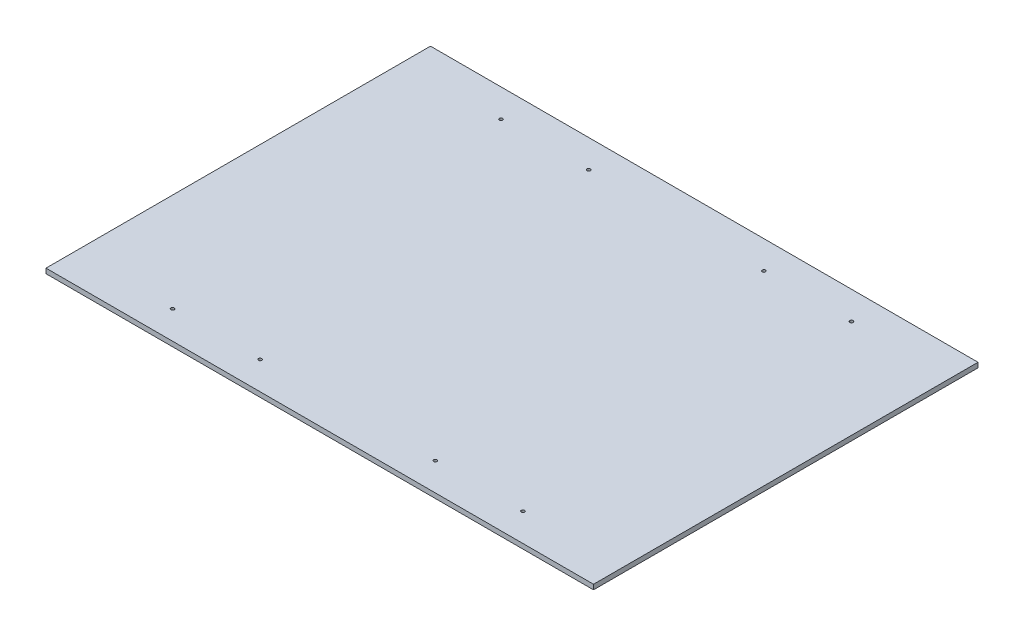
ISO-10303-21;
HEADER;
FILE_DESCRIPTION(('STEP AP214'),'2;1');
FILE_NAME('part.step','',(''),(''),'','','');
FILE_SCHEMA(('AUTOMOTIVE_DESIGN { 1 0 10303 214 1 1 1 1 }'));
ENDSEC;
DATA;
#1=APPLICATION_CONTEXT('core data for automotive mechanical design processes');
#2=APPLICATION_PROTOCOL_DEFINITION('international standard','automotive_design',2000,#1);
#3=PRODUCT_CONTEXT('',#1,'mechanical');
#4=PRODUCT('Part','Part','',(#3));
#5=PRODUCT_RELATED_PRODUCT_CATEGORY('part','',(#4));
#6=PRODUCT_DEFINITION_FORMATION('','',#4);
#7=PRODUCT_DEFINITION_CONTEXT('part definition',#1,'design');
#8=PRODUCT_DEFINITION('design','',#6,#7);
#9=PRODUCT_DEFINITION_SHAPE('','',#8);
#10=(LENGTH_UNIT() NAMED_UNIT(*) SI_UNIT(.MILLI.,.METRE.));
#11=(NAMED_UNIT(*) PLANE_ANGLE_UNIT() SI_UNIT($,.RADIAN.));
#12=(NAMED_UNIT(*) SI_UNIT($,.STERADIAN.) SOLID_ANGLE_UNIT());
#13=UNCERTAINTY_MEASURE_WITH_UNIT(LENGTH_MEASURE(1.E-05),#10,'distance_accuracy_value','');
#14=(GEOMETRIC_REPRESENTATION_CONTEXT(3) GLOBAL_UNCERTAINTY_ASSIGNED_CONTEXT((#13)) GLOBAL_UNIT_ASSIGNED_CONTEXT((#10,
#11,#12)) REPRESENTATION_CONTEXT('',''));
#15=CARTESIAN_POINT('',(0.,0.,0.));
#16=DIRECTION('',(0.,0.,1.));
#17=DIRECTION('',(1.,0.,0.));
#18=AXIS2_PLACEMENT_3D('',#15,#16,#17);
#19=CARTESIAN_POINT('',(357.1875,6.35,250.825));
#20=DIRECTION('',(-1.,0.,0.));
#21=DIRECTION('',(0.,0.,1.));
#22=AXIS2_PLACEMENT_3D('',#19,#20,#21);
#23=PLANE('',#22);
#24=DIRECTION('',(0.,0.,-1.));
#25=VECTOR('',#24,1.);
#26=CARTESIAN_POINT('',(357.1875,0.,250.825));
#27=LINE('',#26,#25);
#28=CARTESIAN_POINT('',(357.1875,0.,250.825));
#29=VERTEX_POINT('',#28);
#30=CARTESIAN_POINT('',(357.1875,0.,-250.825));
#31=VERTEX_POINT('',#30);
#32=EDGE_CURVE('E95',#29,#31,#27,.T.);
#33=ORIENTED_EDGE('',*,*,#32,.T.);
#34=DIRECTION('',(0.,-1.,0.));
#35=VECTOR('',#34,1.);
#36=CARTESIAN_POINT('',(357.1875,6.35,-250.825));
#37=LINE('',#36,#35);
#38=CARTESIAN_POINT('',(357.1875,6.35,-250.825));
#39=VERTEX_POINT('',#38);
#40=EDGE_CURVE('E11',#39,#31,#37,.T.);
#41=ORIENTED_EDGE('',*,*,#40,.F.);
#42=DIRECTION('',(0.,0.,-1.));
#43=VECTOR('',#42,1.);
#44=CARTESIAN_POINT('',(357.1875,6.35,250.825));
#45=LINE('',#44,#43);
#46=CARTESIAN_POINT('',(357.1875,6.35,250.825));
#47=VERTEX_POINT('',#46);
#48=EDGE_CURVE('E83',#47,#39,#45,.T.);
#49=ORIENTED_EDGE('',*,*,#48,.F.);
#50=DIRECTION('',(0.,-1.,0.));
#51=VECTOR('',#50,1.);
#52=CARTESIAN_POINT('',(357.1875,6.35,250.825));
#53=LINE('',#52,#51);
#54=EDGE_CURVE('E91',#47,#29,#53,.T.);
#55=ORIENTED_EDGE('',*,*,#54,.T.);
#56=EDGE_LOOP('',(#33,#41,#49,#55));
#57=FACE_BOUND('',#56,.T.);
#58=ADVANCED_FACE('F32',(#57),#23,.F.);
#59=CARTESIAN_POINT('',(-357.1875,6.35,-250.825));
#60=DIRECTION('',(0.,0.,1.));
#61=DIRECTION('',(1.,0.,0.));
#62=AXIS2_PLACEMENT_3D('',#59,#60,#61);
#63=PLANE('',#62);
#64=DIRECTION('',(-1.,0.,0.));
#65=VECTOR('',#64,1.);
#66=CARTESIAN_POINT('',(-357.1875,0.,-250.825));
#67=LINE('',#66,#65);
#68=CARTESIAN_POINT('',(-357.1875,0.,-250.825));
#69=VERTEX_POINT('',#68);
#70=EDGE_CURVE('E87',#31,#69,#67,.T.);
#71=ORIENTED_EDGE('',*,*,#70,.T.);
#72=DIRECTION('',(0.,-1.,0.));
#73=VECTOR('',#72,1.);
#74=CARTESIAN_POINT('',(-357.1875,6.35,-250.825));
#75=LINE('',#74,#73);
#76=CARTESIAN_POINT('',(-357.1875,6.35,-250.825));
#77=VERTEX_POINT('',#76);
#78=EDGE_CURVE('E40',#77,#69,#75,.T.);
#79=ORIENTED_EDGE('',*,*,#78,.F.);
#80=DIRECTION('',(-1.,0.,0.));
#81=VECTOR('',#80,1.);
#82=CARTESIAN_POINT('',(-357.1875,6.35,-250.825));
#83=LINE('',#82,#81);
#84=EDGE_CURVE('E78',#39,#77,#83,.T.);
#85=ORIENTED_EDGE('',*,*,#84,.F.);
#86=ORIENTED_EDGE('',*,*,#40,.T.);
#87=EDGE_LOOP('',(#71,#79,#85,#86));
#88=FACE_BOUND('',#87,.T.);
#89=ADVANCED_FACE('F86',(#88),#63,.F.);
#90=CARTESIAN_POINT('',(-357.1875,6.35,250.825));
#91=DIRECTION('',(1.,0.,0.));
#92=DIRECTION('',(0.,0.,-1.));
#93=AXIS2_PLACEMENT_3D('',#90,#91,#92);
#94=PLANE('',#93);
#95=DIRECTION('',(0.,0.,1.));
#96=VECTOR('',#95,1.);
#97=CARTESIAN_POINT('',(-357.1875,0.,250.825));
#98=LINE('',#97,#96);
#99=CARTESIAN_POINT('',(-357.1875,0.,250.825));
#100=VERTEX_POINT('',#99);
#101=EDGE_CURVE('E65',#69,#100,#98,.T.);
#102=ORIENTED_EDGE('',*,*,#101,.T.);
#103=DIRECTION('',(0.,-1.,0.));
#104=VECTOR('',#103,1.);
#105=CARTESIAN_POINT('',(-357.1875,6.35,250.825));
#106=LINE('',#105,#104);
#107=CARTESIAN_POINT('',(-357.1875,6.35,250.825));
#108=VERTEX_POINT('',#107);
#109=EDGE_CURVE('E88',#108,#100,#106,.T.);
#110=ORIENTED_EDGE('',*,*,#109,.F.);
#111=DIRECTION('',(0.,0.,1.));
#112=VECTOR('',#111,1.);
#113=CARTESIAN_POINT('',(-357.1875,6.35,250.825));
#114=LINE('',#113,#112);
#115=EDGE_CURVE('E81',#77,#108,#114,.T.);
#116=ORIENTED_EDGE('',*,*,#115,.F.);
#117=ORIENTED_EDGE('',*,*,#78,.T.);
#118=EDGE_LOOP('',(#102,#110,#116,#117));
#119=FACE_BOUND('',#118,.T.);
#120=ADVANCED_FACE('F89',(#119),#94,.F.);
#121=CARTESIAN_POINT('',(-357.1875,6.35,250.825));
#122=DIRECTION('',(0.,0.,-1.));
#123=DIRECTION('',(-1.,0.,0.));
#124=AXIS2_PLACEMENT_3D('',#121,#122,#123);
#125=PLANE('',#124);
#126=DIRECTION('',(1.,0.,0.));
#127=VECTOR('',#126,1.);
#128=CARTESIAN_POINT('',(-357.1875,0.,250.825));
#129=LINE('',#128,#127);
#130=EDGE_CURVE('E71',#100,#29,#129,.T.);
#131=ORIENTED_EDGE('',*,*,#130,.T.);
#132=ORIENTED_EDGE('',*,*,#54,.F.);
#133=DIRECTION('',(1.,0.,0.));
#134=VECTOR('',#133,1.);
#135=CARTESIAN_POINT('',(-357.1875,6.35,250.825));
#136=LINE('',#135,#134);
#137=EDGE_CURVE('E48',#108,#47,#136,.T.);
#138=ORIENTED_EDGE('',*,*,#137,.F.);
#139=ORIENTED_EDGE('',*,*,#109,.T.);
#140=EDGE_LOOP('',(#131,#132,#138,#139));
#141=FACE_BOUND('',#140,.T.);
#142=ADVANCED_FACE('F103',(#141),#125,.F.);
#143=CARTESIAN_POINT('',(0.,6.35,0.));
#144=DIRECTION('',(0.,-1.,0.));
#145=DIRECTION('',(0.,0.,-1.));
#146=AXIS2_PLACEMENT_3D('',#143,#144,#145);
#147=PLANE('',#146);
#148=CARTESIAN_POINT('',(-114.3,6.35,-214.3125));
#149=DIRECTION('',(0.,1.,0.));
#150=DIRECTION('',(0.,0.,-1.));
#151=AXIS2_PLACEMENT_3D('',#148,#149,#150);
#152=CIRCLE('',#151,2.15265000000001);
#153=CARTESIAN_POINT('',(-114.3,6.35,-216.46515));
#154=VERTEX_POINT('',#153);
#155=EDGE_CURVE('E151',#154,#154,#152,.T.);
#156=ORIENTED_EDGE('',*,*,#155,.F.);
#157=EDGE_LOOP('',(#156));
#158=FACE_BOUND('',#157,.T.);
#159=CARTESIAN_POINT('',(-228.6,6.35,-214.3125));
#160=DIRECTION('',(0.,1.,0.));
#161=DIRECTION('',(0.,0.,-1.));
#162=AXIS2_PLACEMENT_3D('',#159,#160,#161);
#163=CIRCLE('',#162,2.15265000000001);
#164=CARTESIAN_POINT('',(-228.6,6.35,-216.46515));
#165=VERTEX_POINT('',#164);
#166=EDGE_CURVE('E145',#165,#165,#163,.T.);
#167=ORIENTED_EDGE('',*,*,#166,.F.);
#168=EDGE_LOOP('',(#167));
#169=FACE_BOUND('',#168,.T.);
#170=CARTESIAN_POINT('',(228.6,6.35,-214.3125));
#171=DIRECTION('',(0.,1.,0.));
#172=DIRECTION('',(0.,0.,1.));
#173=AXIS2_PLACEMENT_3D('',#170,#171,#172);
#174=CIRCLE('',#173,2.15265000000001);
#175=CARTESIAN_POINT('',(228.6,6.35,-212.15985));
#176=VERTEX_POINT('',#175);
#177=EDGE_CURVE('E139',#176,#176,#174,.T.);
#178=ORIENTED_EDGE('',*,*,#177,.F.);
#179=EDGE_LOOP('',(#178));
#180=FACE_BOUND('',#179,.T.);
#181=CARTESIAN_POINT('',(114.3,6.35,-214.3125));
#182=DIRECTION('',(0.,1.,0.));
#183=DIRECTION('',(0.,0.,1.));
#184=AXIS2_PLACEMENT_3D('',#181,#182,#183);
#185=CIRCLE('',#184,2.15265000000001);
#186=CARTESIAN_POINT('',(114.3,6.35,-212.15985));
#187=VERTEX_POINT('',#186);
#188=EDGE_CURVE('E133',#187,#187,#185,.T.);
#189=ORIENTED_EDGE('',*,*,#188,.F.);
#190=EDGE_LOOP('',(#189));
#191=FACE_BOUND('',#190,.T.);
#192=CARTESIAN_POINT('',(114.3,6.35,214.3125));
#193=DIRECTION('',(0.,1.,0.));
#194=DIRECTION('',(0.,0.,-1.));
#195=AXIS2_PLACEMENT_3D('',#192,#193,#194);
#196=CIRCLE('',#195,2.15265000000001);
#197=CARTESIAN_POINT('',(114.3,6.35,212.15985));
#198=VERTEX_POINT('',#197);
#199=EDGE_CURVE('E127',#198,#198,#196,.T.);
#200=ORIENTED_EDGE('',*,*,#199,.F.);
#201=EDGE_LOOP('',(#200));
#202=FACE_BOUND('',#201,.T.);
#203=CARTESIAN_POINT('',(228.6,6.35,214.3125));
#204=DIRECTION('',(0.,1.,0.));
#205=DIRECTION('',(0.,0.,-1.));
#206=AXIS2_PLACEMENT_3D('',#203,#204,#205);
#207=CIRCLE('',#206,2.15265000000001);
#208=CARTESIAN_POINT('',(228.6,6.35,212.15985));
#209=VERTEX_POINT('',#208);
#210=EDGE_CURVE('E121',#209,#209,#207,.T.);
#211=ORIENTED_EDGE('',*,*,#210,.F.);
#212=EDGE_LOOP('',(#211));
#213=FACE_BOUND('',#212,.T.);
#214=CARTESIAN_POINT('',(-228.6,6.35,214.3125));
#215=DIRECTION('',(0.,1.,0.));
#216=DIRECTION('',(0.,0.,1.));
#217=AXIS2_PLACEMENT_3D('',#214,#215,#216);
#218=CIRCLE('',#217,2.15265000000001);
#219=CARTESIAN_POINT('',(-228.6,6.35,216.46515));
#220=VERTEX_POINT('',#219);
#221=EDGE_CURVE('E115',#220,#220,#218,.T.);
#222=ORIENTED_EDGE('',*,*,#221,.F.);
#223=EDGE_LOOP('',(#222));
#224=FACE_BOUND('',#223,.T.);
#225=CARTESIAN_POINT('',(-114.3,6.35,214.3125));
#226=DIRECTION('',(0.,1.,0.));
#227=DIRECTION('',(0.,0.,1.));
#228=AXIS2_PLACEMENT_3D('',#225,#226,#227);
#229=CIRCLE('',#228,2.15265000000001);
#230=CARTESIAN_POINT('',(-114.3,6.35,216.46515));
#231=VERTEX_POINT('',#230);
#232=EDGE_CURVE('E109',#231,#231,#229,.T.);
#233=ORIENTED_EDGE('',*,*,#232,.F.);
#234=EDGE_LOOP('',(#233));
#235=FACE_BOUND('',#234,.T.);
#236=ORIENTED_EDGE('',*,*,#48,.T.);
#237=ORIENTED_EDGE('',*,*,#84,.T.);
#238=ORIENTED_EDGE('',*,*,#115,.T.);
#239=ORIENTED_EDGE('',*,*,#137,.T.);
#240=EDGE_LOOP('',(#236,#237,#238,#239));
#241=FACE_BOUND('',#240,.T.);
#242=ADVANCED_FACE('F79',(#158,#169,#180,#191,#202,#213,#224,#235,#241),#147,.F.);
#243=CARTESIAN_POINT('',(0.,0.,0.));
#244=DIRECTION('',(0.,-1.,0.));
#245=DIRECTION('',(0.,0.,-1.));
#246=AXIS2_PLACEMENT_3D('',#243,#244,#245);
#247=PLANE('',#246);
#248=CARTESIAN_POINT('',(-114.3,0.,-214.3125));
#249=DIRECTION('',(0.,1.,0.));
#250=DIRECTION('',(0.,0.,-1.));
#251=AXIS2_PLACEMENT_3D('',#248,#249,#250);
#252=CIRCLE('',#251,2.15265000000001);
#253=CARTESIAN_POINT('',(-114.3,0.,-216.46515));
#254=VERTEX_POINT('',#253);
#255=EDGE_CURVE('E148',#254,#254,#252,.T.);
#256=ORIENTED_EDGE('',*,*,#255,.T.);
#257=EDGE_LOOP('',(#256));
#258=FACE_BOUND('',#257,.T.);
#259=CARTESIAN_POINT('',(-228.6,0.,-214.3125));
#260=DIRECTION('',(0.,1.,0.));
#261=DIRECTION('',(0.,0.,-1.));
#262=AXIS2_PLACEMENT_3D('',#259,#260,#261);
#263=CIRCLE('',#262,2.15265000000001);
#264=CARTESIAN_POINT('',(-228.6,0.,-216.46515));
#265=VERTEX_POINT('',#264);
#266=EDGE_CURVE('E142',#265,#265,#263,.T.);
#267=ORIENTED_EDGE('',*,*,#266,.T.);
#268=EDGE_LOOP('',(#267));
#269=FACE_BOUND('',#268,.T.);
#270=CARTESIAN_POINT('',(228.6,0.,-214.3125));
#271=DIRECTION('',(0.,1.,0.));
#272=DIRECTION('',(0.,0.,1.));
#273=AXIS2_PLACEMENT_3D('',#270,#271,#272);
#274=CIRCLE('',#273,2.15265000000001);
#275=CARTESIAN_POINT('',(228.6,0.,-212.15985));
#276=VERTEX_POINT('',#275);
#277=EDGE_CURVE('E136',#276,#276,#274,.T.);
#278=ORIENTED_EDGE('',*,*,#277,.T.);
#279=EDGE_LOOP('',(#278));
#280=FACE_BOUND('',#279,.T.);
#281=CARTESIAN_POINT('',(114.3,0.,-214.3125));
#282=DIRECTION('',(0.,1.,0.));
#283=DIRECTION('',(0.,0.,1.));
#284=AXIS2_PLACEMENT_3D('',#281,#282,#283);
#285=CIRCLE('',#284,2.15265000000001);
#286=CARTESIAN_POINT('',(114.3,0.,-212.15985));
#287=VERTEX_POINT('',#286);
#288=EDGE_CURVE('E130',#287,#287,#285,.T.);
#289=ORIENTED_EDGE('',*,*,#288,.T.);
#290=EDGE_LOOP('',(#289));
#291=FACE_BOUND('',#290,.T.);
#292=CARTESIAN_POINT('',(114.3,0.,214.3125));
#293=DIRECTION('',(0.,1.,0.));
#294=DIRECTION('',(0.,0.,-1.));
#295=AXIS2_PLACEMENT_3D('',#292,#293,#294);
#296=CIRCLE('',#295,2.15265000000001);
#297=CARTESIAN_POINT('',(114.3,0.,212.15985));
#298=VERTEX_POINT('',#297);
#299=EDGE_CURVE('E124',#298,#298,#296,.T.);
#300=ORIENTED_EDGE('',*,*,#299,.T.);
#301=EDGE_LOOP('',(#300));
#302=FACE_BOUND('',#301,.T.);
#303=CARTESIAN_POINT('',(228.6,0.,214.3125));
#304=DIRECTION('',(0.,1.,0.));
#305=DIRECTION('',(0.,0.,-1.));
#306=AXIS2_PLACEMENT_3D('',#303,#304,#305);
#307=CIRCLE('',#306,2.15265000000001);
#308=CARTESIAN_POINT('',(228.6,0.,212.15985));
#309=VERTEX_POINT('',#308);
#310=EDGE_CURVE('E118',#309,#309,#307,.T.);
#311=ORIENTED_EDGE('',*,*,#310,.T.);
#312=EDGE_LOOP('',(#311));
#313=FACE_BOUND('',#312,.T.);
#314=CARTESIAN_POINT('',(-228.6,0.,214.3125));
#315=DIRECTION('',(0.,1.,0.));
#316=DIRECTION('',(0.,0.,1.));
#317=AXIS2_PLACEMENT_3D('',#314,#315,#316);
#318=CIRCLE('',#317,2.15265000000001);
#319=CARTESIAN_POINT('',(-228.6,0.,216.46515));
#320=VERTEX_POINT('',#319);
#321=EDGE_CURVE('E112',#320,#320,#318,.T.);
#322=ORIENTED_EDGE('',*,*,#321,.T.);
#323=EDGE_LOOP('',(#322));
#324=FACE_BOUND('',#323,.T.);
#325=CARTESIAN_POINT('',(-114.3,0.,214.3125));
#326=DIRECTION('',(0.,1.,0.));
#327=DIRECTION('',(0.,0.,1.));
#328=AXIS2_PLACEMENT_3D('',#325,#326,#327);
#329=CIRCLE('',#328,2.15265000000001);
#330=CARTESIAN_POINT('',(-114.3,0.,216.46515));
#331=VERTEX_POINT('',#330);
#332=EDGE_CURVE('E98',#331,#331,#329,.T.);
#333=ORIENTED_EDGE('',*,*,#332,.T.);
#334=EDGE_LOOP('',(#333));
#335=FACE_BOUND('',#334,.T.);
#336=ORIENTED_EDGE('',*,*,#32,.F.);
#337=ORIENTED_EDGE('',*,*,#130,.F.);
#338=ORIENTED_EDGE('',*,*,#101,.F.);
#339=ORIENTED_EDGE('',*,*,#70,.F.);
#340=EDGE_LOOP('',(#336,#337,#338,#339));
#341=FACE_BOUND('',#340,.T.);
#342=ADVANCED_FACE('F106',(#258,#269,#280,#291,#302,#313,#324,#335,#341),#247,.T.);
#343=CARTESIAN_POINT('',(-114.3,0.,214.3125));
#344=DIRECTION('',(0.,1.,0.));
#345=DIRECTION('',(0.,0.,1.));
#346=AXIS2_PLACEMENT_3D('',#343,#344,#345);
#347=CYLINDRICAL_SURFACE('',#346,2.15265000000001);
#348=ORIENTED_EDGE('',*,*,#332,.F.);
#349=EDGE_LOOP('',(#348));
#350=FACE_BOUND('',#349,.T.);
#351=ORIENTED_EDGE('',*,*,#232,.T.);
#352=EDGE_LOOP('',(#351));
#353=FACE_BOUND('',#352,.T.);
#354=ADVANCED_FACE('F183',(#350,#353),#347,.F.);
#355=CARTESIAN_POINT('',(-228.6,0.,214.3125));
#356=DIRECTION('',(0.,1.,0.));
#357=DIRECTION('',(0.,0.,1.));
#358=AXIS2_PLACEMENT_3D('',#355,#356,#357);
#359=CYLINDRICAL_SURFACE('',#358,2.15265000000001);
#360=ORIENTED_EDGE('',*,*,#321,.F.);
#361=EDGE_LOOP('',(#360));
#362=FACE_BOUND('',#361,.T.);
#363=ORIENTED_EDGE('',*,*,#221,.T.);
#364=EDGE_LOOP('',(#363));
#365=FACE_BOUND('',#364,.T.);
#366=ADVANCED_FACE('F185',(#362,#365),#359,.F.);
#367=CARTESIAN_POINT('',(228.6,0.,214.3125));
#368=DIRECTION('',(0.,1.,0.));
#369=DIRECTION('',(0.,0.,1.));
#370=AXIS2_PLACEMENT_3D('',#367,#368,#369);
#371=CYLINDRICAL_SURFACE('',#370,2.15265000000001);
#372=ORIENTED_EDGE('',*,*,#310,.F.);
#373=EDGE_LOOP('',(#372));
#374=FACE_BOUND('',#373,.T.);
#375=ORIENTED_EDGE('',*,*,#210,.T.);
#376=EDGE_LOOP('',(#375));
#377=FACE_BOUND('',#376,.T.);
#378=ADVANCED_FACE('F192',(#374,#377),#371,.F.);
#379=CARTESIAN_POINT('',(114.3,0.,214.3125));
#380=DIRECTION('',(0.,1.,0.));
#381=DIRECTION('',(0.,0.,1.));
#382=AXIS2_PLACEMENT_3D('',#379,#380,#381);
#383=CYLINDRICAL_SURFACE('',#382,2.15265000000001);
#384=ORIENTED_EDGE('',*,*,#299,.F.);
#385=EDGE_LOOP('',(#384));
#386=FACE_BOUND('',#385,.T.);
#387=ORIENTED_EDGE('',*,*,#199,.T.);
#388=EDGE_LOOP('',(#387));
#389=FACE_BOUND('',#388,.T.);
#390=ADVANCED_FACE('F240',(#386,#389),#383,.F.);
#391=CARTESIAN_POINT('',(114.3,0.,-214.3125));
#392=DIRECTION('',(0.,1.,0.));
#393=DIRECTION('',(0.,0.,1.));
#394=AXIS2_PLACEMENT_3D('',#391,#392,#393);
#395=CYLINDRICAL_SURFACE('',#394,2.15265000000001);
#396=ORIENTED_EDGE('',*,*,#288,.F.);
#397=EDGE_LOOP('',(#396));
#398=FACE_BOUND('',#397,.T.);
#399=ORIENTED_EDGE('',*,*,#188,.T.);
#400=EDGE_LOOP('',(#399));
#401=FACE_BOUND('',#400,.T.);
#402=ADVANCED_FACE('F250',(#398,#401),#395,.F.);
#403=CARTESIAN_POINT('',(228.6,0.,-214.3125));
#404=DIRECTION('',(0.,1.,0.));
#405=DIRECTION('',(0.,0.,1.));
#406=AXIS2_PLACEMENT_3D('',#403,#404,#405);
#407=CYLINDRICAL_SURFACE('',#406,2.15265000000001);
#408=ORIENTED_EDGE('',*,*,#277,.F.);
#409=EDGE_LOOP('',(#408));
#410=FACE_BOUND('',#409,.T.);
#411=ORIENTED_EDGE('',*,*,#177,.T.);
#412=EDGE_LOOP('',(#411));
#413=FACE_BOUND('',#412,.T.);
#414=ADVANCED_FACE('F260',(#410,#413),#407,.F.);
#415=CARTESIAN_POINT('',(-228.6,0.,-214.3125));
#416=DIRECTION('',(0.,1.,0.));
#417=DIRECTION('',(0.,0.,1.));
#418=AXIS2_PLACEMENT_3D('',#415,#416,#417);
#419=CYLINDRICAL_SURFACE('',#418,2.15265000000001);
#420=ORIENTED_EDGE('',*,*,#266,.F.);
#421=EDGE_LOOP('',(#420));
#422=FACE_BOUND('',#421,.T.);
#423=ORIENTED_EDGE('',*,*,#166,.T.);
#424=EDGE_LOOP('',(#423));
#425=FACE_BOUND('',#424,.T.);
#426=ADVANCED_FACE('F162',(#422,#425),#419,.F.);
#427=CARTESIAN_POINT('',(-114.3,0.,-214.3125));
#428=DIRECTION('',(0.,1.,0.));
#429=DIRECTION('',(0.,0.,1.));
#430=AXIS2_PLACEMENT_3D('',#427,#428,#429);
#431=CYLINDRICAL_SURFACE('',#430,2.15265000000001);
#432=ORIENTED_EDGE('',*,*,#255,.F.);
#433=EDGE_LOOP('',(#432));
#434=FACE_BOUND('',#433,.T.);
#435=ORIENTED_EDGE('',*,*,#155,.T.);
#436=EDGE_LOOP('',(#435));
#437=FACE_BOUND('',#436,.T.);
#438=ADVANCED_FACE('F159',(#434,#437),#431,.F.);
#439=CLOSED_SHELL('',(#58,#89,#120,#142,#242,#342,#354,#366,#378,#390,#402,#414,#426,#438));
#440=MANIFOLD_SOLID_BREP('B2',#439);
#441=ADVANCED_BREP_SHAPE_REPRESENTATION('',(#18,#440),#14);
#442=SHAPE_DEFINITION_REPRESENTATION(#9,#441);
ENDSEC;
END-ISO-10303-21;
